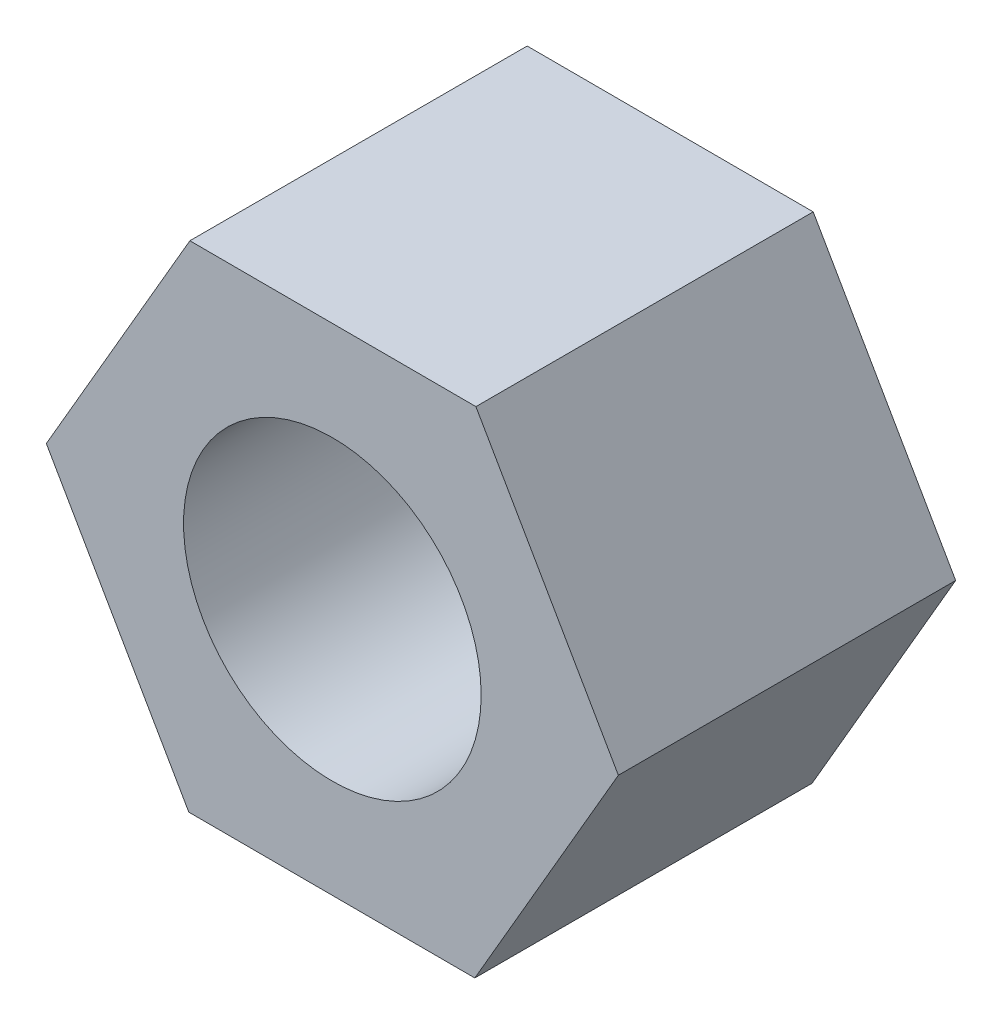
ISO-10303-21;
HEADER;
FILE_DESCRIPTION(('STEP AP214'),'2;1');
FILE_NAME('part.step','',(''),(''),'','','');
FILE_SCHEMA(('AUTOMOTIVE_DESIGN { 1 0 10303 214 1 1 1 1 }'));
ENDSEC;
DATA;
#1=APPLICATION_CONTEXT('core data for automotive mechanical design processes');
#2=APPLICATION_PROTOCOL_DEFINITION('international standard','automotive_design',2000,#1);
#3=PRODUCT_CONTEXT('',#1,'mechanical');
#4=PRODUCT('Part','Part','',(#3));
#5=PRODUCT_RELATED_PRODUCT_CATEGORY('part','',(#4));
#6=PRODUCT_DEFINITION_FORMATION('','',#4);
#7=PRODUCT_DEFINITION_CONTEXT('part definition',#1,'design');
#8=PRODUCT_DEFINITION('design','',#6,#7);
#9=PRODUCT_DEFINITION_SHAPE('','',#8);
#10=(LENGTH_UNIT() NAMED_UNIT(*) SI_UNIT(.MILLI.,.METRE.));
#11=(NAMED_UNIT(*) PLANE_ANGLE_UNIT() SI_UNIT($,.RADIAN.));
#12=(NAMED_UNIT(*) SI_UNIT($,.STERADIAN.) SOLID_ANGLE_UNIT());
#13=UNCERTAINTY_MEASURE_WITH_UNIT(LENGTH_MEASURE(1.E-05),#10,'distance_accuracy_value','');
#14=(GEOMETRIC_REPRESENTATION_CONTEXT(3) GLOBAL_UNCERTAINTY_ASSIGNED_CONTEXT((#13)) GLOBAL_UNIT_ASSIGNED_CONTEXT((#10,
#11,#12)) REPRESENTATION_CONTEXT('',''));
#15=CARTESIAN_POINT('',(0.,0.,0.));
#16=DIRECTION('',(0.,0.,1.));
#17=DIRECTION('',(1.,0.,0.));
#18=AXIS2_PLACEMENT_3D('',#15,#16,#17);
#19=CARTESIAN_POINT('',(2.89413033414292,4.98721921753811,6.8));
#20=DIRECTION('',(-0.00221652391150812,-0.999997543507858,0.));
#21=DIRECTION('',(0.999997543507858,-0.00221652391150812,0.));
#22=AXIS2_PLACEMENT_3D('',#19,#20,#21);
#23=PLANE('',#22);
#24=DIRECTION('',(-0.999997543507858,0.00221652391150812,0.));
#25=VECTOR('',#24,1.);
#26=CARTESIAN_POINT('',(2.89413033414292,4.98721921753811,0.));
#27=LINE('',#26,#25);
#28=CARTESIAN_POINT('',(2.89413033414292,4.98721921753811,0.));
#29=VERTEX_POINT('',#28);
#30=CARTESIAN_POINT('',(-2.8719933695585,4.99999999999997,0.));
#31=VERTEX_POINT('',#30);
#32=EDGE_CURVE('E120',#29,#31,#27,.T.);
#33=ORIENTED_EDGE('',*,*,#32,.T.);
#34=DIRECTION('',(0.,0.,-1.));
#35=VECTOR('',#34,1.);
#36=CARTESIAN_POINT('',(-2.8719933695585,4.99999999999997,6.8));
#37=LINE('',#36,#35);
#38=CARTESIAN_POINT('',(-2.8719933695585,4.99999999999997,6.8));
#39=VERTEX_POINT('',#38);
#40=EDGE_CURVE('E11',#39,#31,#37,.T.);
#41=ORIENTED_EDGE('',*,*,#40,.F.);
#42=DIRECTION('',(-0.999997543507858,0.00221652391150812,0.));
#43=VECTOR('',#42,1.);
#44=CARTESIAN_POINT('',(2.89413033414292,4.98721921753811,6.8));
#45=LINE('',#44,#43);
#46=CARTESIAN_POINT('',(2.89413033414292,4.98721921753811,6.8));
#47=VERTEX_POINT('',#46);
#48=EDGE_CURVE('E131',#47,#39,#45,.T.);
#49=ORIENTED_EDGE('',*,*,#48,.F.);
#50=DIRECTION('',(0.,0.,-1.));
#51=VECTOR('',#50,1.);
#52=CARTESIAN_POINT('',(2.89413033414292,4.98721921753811,6.8));
#53=LINE('',#52,#51);
#54=EDGE_CURVE('E116',#47,#29,#53,.T.);
#55=ORIENTED_EDGE('',*,*,#54,.T.);
#56=EDGE_LOOP('',(#33,#41,#49,#55));
#57=FACE_BOUND('',#56,.T.);
#58=ADVANCED_FACE('F36',(#57),#23,.F.);
#59=CARTESIAN_POINT('',(-2.8719933695585,4.99999999999997,6.8));
#60=DIRECTION('',(0.864915014444085,-0.50191833776939,0.));
#61=DIRECTION('',(0.50191833776939,0.864915014444085,0.));
#62=AXIS2_PLACEMENT_3D('',#59,#60,#61);
#63=PLANE('',#62);
#64=DIRECTION('',(-0.50191833776939,-0.864915014444085,0.));
#65=VECTOR('',#64,1.);
#66=CARTESIAN_POINT('',(-2.8719933695585,4.99999999999997,0.));
#67=LINE('',#66,#65);
#68=CARTESIAN_POINT('',(-5.76612370370141,0.0127807824618601,0.));
#69=VERTEX_POINT('',#68);
#70=EDGE_CURVE('E123',#31,#69,#67,.T.);
#71=ORIENTED_EDGE('',*,*,#70,.T.);
#72=DIRECTION('',(0.,0.,-1.));
#73=VECTOR('',#72,1.);
#74=CARTESIAN_POINT('',(-5.76612370370141,0.0127807824618601,6.8));
#75=LINE('',#74,#73);
#76=CARTESIAN_POINT('',(-5.76612370370141,0.0127807824618601,6.8));
#77=VERTEX_POINT('',#76);
#78=EDGE_CURVE('E44',#77,#69,#75,.T.);
#79=ORIENTED_EDGE('',*,*,#78,.F.);
#80=DIRECTION('',(-0.50191833776939,-0.864915014444085,0.));
#81=VECTOR('',#80,1.);
#82=CARTESIAN_POINT('',(-2.8719933695585,4.99999999999997,6.8));
#83=LINE('',#82,#81);
#84=EDGE_CURVE('E89',#39,#77,#83,.T.);
#85=ORIENTED_EDGE('',*,*,#84,.F.);
#86=ORIENTED_EDGE('',*,*,#40,.T.);
#87=EDGE_LOOP('',(#71,#79,#85,#86));
#88=FACE_BOUND('',#87,.T.);
#89=ADVANCED_FACE('F156',(#88),#63,.F.);
#90=CARTESIAN_POINT('',(-5.76612370370141,0.0127807824618601,6.8));
#91=DIRECTION('',(0.867131538355593,0.498079205738467,0.));
#92=DIRECTION('',(-0.498079205738467,0.867131538355593,0.));
#93=AXIS2_PLACEMENT_3D('',#90,#91,#92);
#94=PLANE('',#93);
#95=DIRECTION('',(0.498079205738467,-0.867131538355593,0.));
#96=VECTOR('',#95,1.);
#97=CARTESIAN_POINT('',(-5.76612370370141,0.0127807824618601,0.));
#98=LINE('',#97,#96);
#99=CARTESIAN_POINT('',(-2.89413033414292,-4.98721921753811,0.));
#100=VERTEX_POINT('',#99);
#101=EDGE_CURVE('E126',#69,#100,#98,.T.);
#102=ORIENTED_EDGE('',*,*,#101,.T.);
#103=DIRECTION('',(0.,0.,-1.));
#104=VECTOR('',#103,1.);
#105=CARTESIAN_POINT('',(-2.89413033414292,-4.98721921753811,6.8));
#106=LINE('',#105,#104);
#107=CARTESIAN_POINT('',(-2.89413033414292,-4.98721921753811,6.8));
#108=VERTEX_POINT('',#107);
#109=EDGE_CURVE('E111',#108,#100,#106,.T.);
#110=ORIENTED_EDGE('',*,*,#109,.F.);
#111=DIRECTION('',(0.498079205738467,-0.867131538355593,0.));
#112=VECTOR('',#111,1.);
#113=CARTESIAN_POINT('',(-5.76612370370141,0.0127807824618601,6.8));
#114=LINE('',#113,#112);
#115=EDGE_CURVE('E102',#77,#108,#114,.T.);
#116=ORIENTED_EDGE('',*,*,#115,.F.);
#117=ORIENTED_EDGE('',*,*,#78,.T.);
#118=EDGE_LOOP('',(#102,#110,#116,#117));
#119=FACE_BOUND('',#118,.T.);
#120=ADVANCED_FACE('F137',(#119),#94,.F.);
#121=CARTESIAN_POINT('',(-2.89413033414292,-4.98721921753811,6.8));
#122=DIRECTION('',(0.00221652391150827,0.999997543507858,0.));
#123=DIRECTION('',(-0.999997543507858,0.00221652391150827,0.));
#124=AXIS2_PLACEMENT_3D('',#121,#122,#123);
#125=PLANE('',#124);
#126=DIRECTION('',(0.999997543507858,-0.00221652391150827,0.));
#127=VECTOR('',#126,1.);
#128=CARTESIAN_POINT('',(-2.89413033414292,-4.98721921753811,0.));
#129=LINE('',#128,#127);
#130=CARTESIAN_POINT('',(2.87199336955849,-4.99999999999997,0.));
#131=VERTEX_POINT('',#130);
#132=EDGE_CURVE('E110',#100,#131,#129,.T.);
#133=ORIENTED_EDGE('',*,*,#132,.T.);
#134=DIRECTION('',(0.,0.,-1.));
#135=VECTOR('',#134,1.);
#136=CARTESIAN_POINT('',(2.87199336955849,-4.99999999999997,6.8));
#137=LINE('',#136,#135);
#138=CARTESIAN_POINT('',(2.87199336955849,-4.99999999999997,6.8));
#139=VERTEX_POINT('',#138);
#140=EDGE_CURVE('E107',#139,#131,#137,.T.);
#141=ORIENTED_EDGE('',*,*,#140,.F.);
#142=DIRECTION('',(0.999997543507858,-0.00221652391150827,0.));
#143=VECTOR('',#142,1.);
#144=CARTESIAN_POINT('',(-2.89413033414292,-4.98721921753811,6.8));
#145=LINE('',#144,#143);
#146=EDGE_CURVE('E96',#108,#139,#145,.T.);
#147=ORIENTED_EDGE('',*,*,#146,.F.);
#148=ORIENTED_EDGE('',*,*,#109,.T.);
#149=EDGE_LOOP('',(#133,#141,#147,#148));
#150=FACE_BOUND('',#149,.T.);
#151=ADVANCED_FACE('F108',(#150),#125,.F.);
#152=CARTESIAN_POINT('',(2.87199336955849,-4.99999999999997,6.8));
#153=DIRECTION('',(-0.864915014444085,0.501918337769391,0.));
#154=DIRECTION('',(-0.501918337769391,-0.864915014444085,0.));
#155=AXIS2_PLACEMENT_3D('',#152,#153,#154);
#156=PLANE('',#155);
#157=DIRECTION('',(0.50191833776939,0.864915014444085,0.));
#158=VECTOR('',#157,1.);
#159=CARTESIAN_POINT('',(2.87199336955849,-4.99999999999997,0.));
#160=LINE('',#159,#158);
#161=CARTESIAN_POINT('',(5.76612370370142,-0.0127807824618596,0.));
#162=VERTEX_POINT('',#161);
#163=EDGE_CURVE('E75',#131,#162,#160,.T.);
#164=ORIENTED_EDGE('',*,*,#163,.T.);
#165=DIRECTION('',(0.,0.,-1.));
#166=VECTOR('',#165,1.);
#167=CARTESIAN_POINT('',(5.76612370370142,-0.0127807824618596,6.8));
#168=LINE('',#167,#166);
#169=CARTESIAN_POINT('',(5.76612370370142,-0.0127807824618596,6.8));
#170=VERTEX_POINT('',#169);
#171=EDGE_CURVE('E112',#170,#162,#168,.T.);
#172=ORIENTED_EDGE('',*,*,#171,.F.);
#173=DIRECTION('',(0.50191833776939,0.864915014444085,0.));
#174=VECTOR('',#173,1.);
#175=CARTESIAN_POINT('',(2.87199336955849,-4.99999999999997,6.8));
#176=LINE('',#175,#174);
#177=EDGE_CURVE('E100',#139,#170,#176,.T.);
#178=ORIENTED_EDGE('',*,*,#177,.F.);
#179=ORIENTED_EDGE('',*,*,#140,.T.);
#180=EDGE_LOOP('',(#164,#172,#178,#179));
#181=FACE_BOUND('',#180,.T.);
#182=ADVANCED_FACE('F114',(#181),#156,.F.);
#183=CARTESIAN_POINT('',(5.76612370370142,-0.0127807824618596,6.8));
#184=DIRECTION('',(-0.867131538355593,-0.498079205738467,0.));
#185=DIRECTION('',(0.498079205738467,-0.867131538355593,0.));
#186=AXIS2_PLACEMENT_3D('',#183,#184,#185);
#187=PLANE('',#186);
#188=DIRECTION('',(-0.498079205738467,0.867131538355593,0.));
#189=VECTOR('',#188,1.);
#190=CARTESIAN_POINT('',(5.76612370370142,-0.0127807824618596,0.));
#191=LINE('',#190,#189);
#192=EDGE_CURVE('E81',#162,#29,#191,.T.);
#193=ORIENTED_EDGE('',*,*,#192,.T.);
#194=ORIENTED_EDGE('',*,*,#54,.F.);
#195=DIRECTION('',(-0.498079205738467,0.867131538355593,0.));
#196=VECTOR('',#195,1.);
#197=CARTESIAN_POINT('',(5.76612370370142,-0.0127807824618596,6.8));
#198=LINE('',#197,#196);
#199=EDGE_CURVE('E52',#170,#47,#198,.T.);
#200=ORIENTED_EDGE('',*,*,#199,.F.);
#201=ORIENTED_EDGE('',*,*,#171,.T.);
#202=EDGE_LOOP('',(#193,#194,#200,#201));
#203=FACE_BOUND('',#202,.T.);
#204=ADVANCED_FACE('F144',(#203),#187,.F.);
#205=CARTESIAN_POINT('',(0.,0.,6.8));
#206=DIRECTION('',(0.,0.,1.));
#207=DIRECTION('',(1.,0.,0.));
#208=AXIS2_PLACEMENT_3D('',#205,#206,#207);
#209=PLANE('',#208);
#210=CARTESIAN_POINT('',(0.,0.,6.8));
#211=DIRECTION('',(0.,0.,1.));
#212=DIRECTION('',(1.,0.,0.));
#213=AXIS2_PLACEMENT_3D('',#210,#211,#212);
#214=CIRCLE('',#213,3.);
#215=CARTESIAN_POINT('',(3.,0.,6.8));
#216=VERTEX_POINT('',#215);
#217=EDGE_CURVE('E124',#216,#216,#214,.F.);
#218=ORIENTED_EDGE('',*,*,#217,.T.);
#219=EDGE_LOOP('',(#218));
#220=FACE_BOUND('',#219,.T.);
#221=ORIENTED_EDGE('',*,*,#48,.T.);
#222=ORIENTED_EDGE('',*,*,#84,.T.);
#223=ORIENTED_EDGE('',*,*,#115,.T.);
#224=ORIENTED_EDGE('',*,*,#146,.T.);
#225=ORIENTED_EDGE('',*,*,#177,.T.);
#226=ORIENTED_EDGE('',*,*,#199,.T.);
#227=EDGE_LOOP('',(#221,#222,#223,#224,#225,#226));
#228=FACE_BOUND('',#227,.T.);
#229=ADVANCED_FACE('F98',(#220,#228),#209,.T.);
#230=CARTESIAN_POINT('',(0.,0.,0.));
#231=DIRECTION('',(0.,0.,1.));
#232=DIRECTION('',(1.,0.,0.));
#233=AXIS2_PLACEMENT_3D('',#230,#231,#232);
#234=PLANE('',#233);
#235=CARTESIAN_POINT('',(0.,0.,0.));
#236=DIRECTION('',(0.,0.,1.));
#237=DIRECTION('',(1.,0.,0.));
#238=AXIS2_PLACEMENT_3D('',#235,#236,#237);
#239=CIRCLE('',#238,3.);
#240=CARTESIAN_POINT('',(3.,0.,0.));
#241=VERTEX_POINT('',#240);
#242=EDGE_CURVE('E211',#241,#241,#239,.T.);
#243=ORIENTED_EDGE('',*,*,#242,.T.);
#244=EDGE_LOOP('',(#243));
#245=FACE_BOUND('',#244,.T.);
#246=ORIENTED_EDGE('',*,*,#32,.F.);
#247=ORIENTED_EDGE('',*,*,#192,.F.);
#248=ORIENTED_EDGE('',*,*,#163,.F.);
#249=ORIENTED_EDGE('',*,*,#132,.F.);
#250=ORIENTED_EDGE('',*,*,#101,.F.);
#251=ORIENTED_EDGE('',*,*,#70,.F.);
#252=EDGE_LOOP('',(#246,#247,#248,#249,#250,#251));
#253=FACE_BOUND('',#252,.T.);
#254=ADVANCED_FACE('F140',(#245,#253),#234,.F.);
#255=CARTESIAN_POINT('',(0.,0.,10.8));
#256=DIRECTION('',(0.,0.,-1.));
#257=DIRECTION('',(-1.,0.,0.));
#258=AXIS2_PLACEMENT_3D('',#255,#256,#257);
#259=CYLINDRICAL_SURFACE('',#258,3.);
#260=ORIENTED_EDGE('',*,*,#217,.F.);
#261=EDGE_LOOP('',(#260));
#262=FACE_BOUND('',#261,.T.);
#263=ORIENTED_EDGE('',*,*,#242,.F.);
#264=EDGE_LOOP('',(#263));
#265=FACE_BOUND('',#264,.T.);
#266=ADVANCED_FACE('F193',(#262,#265),#259,.F.);
#267=CLOSED_SHELL('',(#58,#89,#120,#151,#182,#204,#229,#254,#266));
#268=MANIFOLD_SOLID_BREP('B2',#267);
#269=ADVANCED_BREP_SHAPE_REPRESENTATION('',(#18,#268),#14);
#270=SHAPE_DEFINITION_REPRESENTATION(#9,#269);
ENDSEC;
END-ISO-10303-21;
